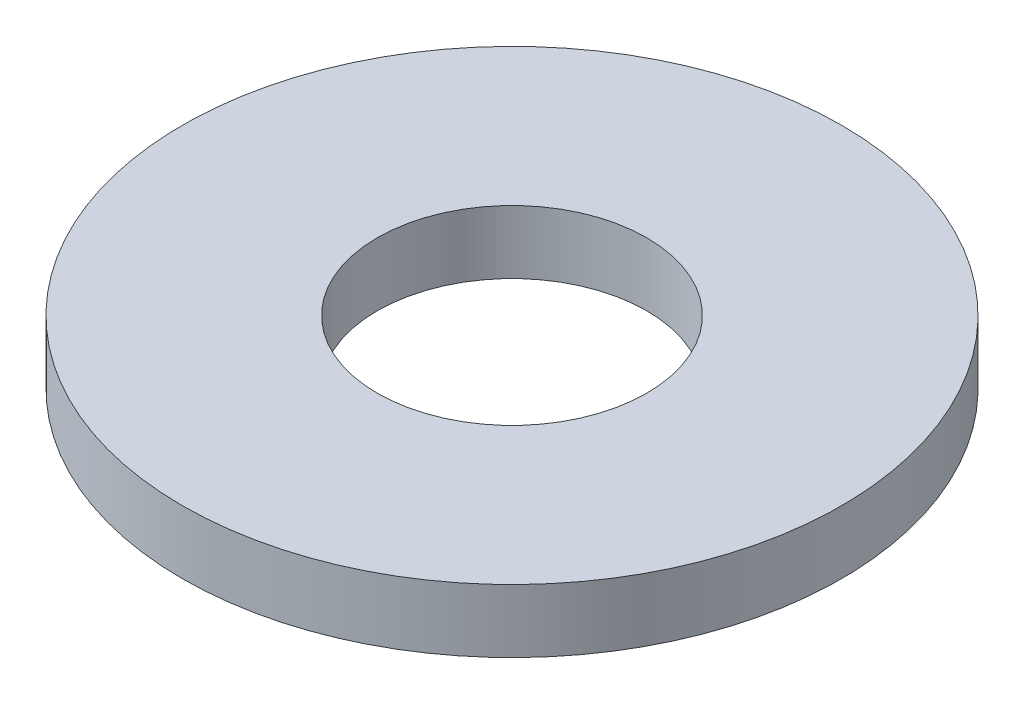
ISO-10303-21;
HEADER;
FILE_DESCRIPTION(('STEP AP214'),'2;1');
FILE_NAME('part.step','',(''),(''),'','','');
FILE_SCHEMA(('AUTOMOTIVE_DESIGN { 1 0 10303 214 1 1 1 1 }'));
ENDSEC;
DATA;
#1=APPLICATION_CONTEXT('core data for automotive mechanical design processes');
#2=APPLICATION_PROTOCOL_DEFINITION('international standard','automotive_design',2000,#1);
#3=PRODUCT_CONTEXT('',#1,'mechanical');
#4=PRODUCT('Part','Part','',(#3));
#5=PRODUCT_RELATED_PRODUCT_CATEGORY('part','',(#4));
#6=PRODUCT_DEFINITION_FORMATION('','',#4);
#7=PRODUCT_DEFINITION_CONTEXT('part definition',#1,'design');
#8=PRODUCT_DEFINITION('design','',#6,#7);
#9=PRODUCT_DEFINITION_SHAPE('','',#8);
#10=(LENGTH_UNIT() NAMED_UNIT(*) SI_UNIT(.MILLI.,.METRE.));
#11=(NAMED_UNIT(*) PLANE_ANGLE_UNIT() SI_UNIT($,.RADIAN.));
#12=(NAMED_UNIT(*) SI_UNIT($,.STERADIAN.) SOLID_ANGLE_UNIT());
#13=UNCERTAINTY_MEASURE_WITH_UNIT(LENGTH_MEASURE(1.E-05),#10,'distance_accuracy_value','');
#14=(GEOMETRIC_REPRESENTATION_CONTEXT(3) GLOBAL_UNCERTAINTY_ASSIGNED_CONTEXT((#13)) GLOBAL_UNIT_ASSIGNED_CONTEXT((#10,
#11,#12)) REPRESENTATION_CONTEXT('',''));
#15=CARTESIAN_POINT('',(0.,0.,0.));
#16=DIRECTION('',(0.,0.,1.));
#17=DIRECTION('',(1.,0.,0.));
#18=AXIS2_PLACEMENT_3D('',#15,#16,#17);
#19=CARTESIAN_POINT('',(0.,3.3528,0.));
#20=DIRECTION('',(0.,-1.,0.));
#21=DIRECTION('',(0.,0.,-1.));
#22=AXIS2_PLACEMENT_3D('',#19,#20,#21);
#23=CYLINDRICAL_SURFACE('',#22,17.4625);
#24=CARTESIAN_POINT('',(0.,3.3528,0.));
#25=DIRECTION('',(0.,1.,0.));
#26=DIRECTION('',(0.,0.,1.));
#27=AXIS2_PLACEMENT_3D('',#24,#25,#26);
#28=CIRCLE('',#27,17.4625);
#29=CARTESIAN_POINT('',(0.,3.3528,17.4625));
#30=VERTEX_POINT('',#29);
#31=EDGE_CURVE('E10',#30,#30,#28,.T.);
#32=ORIENTED_EDGE('',*,*,#31,.F.);
#33=EDGE_LOOP('',(#32));
#34=FACE_BOUND('',#33,.T.);
#35=CARTESIAN_POINT('',(0.,0.,0.));
#36=DIRECTION('',(0.,1.,0.));
#37=DIRECTION('',(0.,0.,1.));
#38=AXIS2_PLACEMENT_3D('',#35,#36,#37);
#39=CIRCLE('',#38,17.4625);
#40=CARTESIAN_POINT('',(0.,0.,17.4625));
#41=VERTEX_POINT('',#40);
#42=EDGE_CURVE('E31',#41,#41,#39,.T.);
#43=ORIENTED_EDGE('',*,*,#42,.T.);
#44=EDGE_LOOP('',(#43));
#45=FACE_BOUND('',#44,.T.);
#46=ADVANCED_FACE('F28',(#34,#45),#23,.T.);
#47=CARTESIAN_POINT('',(0.,3.3528,0.));
#48=DIRECTION('',(0.,1.,0.));
#49=DIRECTION('',(0.,0.,1.));
#50=AXIS2_PLACEMENT_3D('',#47,#48,#49);
#51=PLANE('',#50);
#52=CARTESIAN_POINT('',(0.,3.3528,0.));
#53=DIRECTION('',(0.,1.,0.));
#54=DIRECTION('',(0.,0.,1.));
#55=AXIS2_PLACEMENT_3D('',#52,#53,#54);
#56=CIRCLE('',#55,7.1374);
#57=CARTESIAN_POINT('',(0.,3.3528,7.1374));
#58=VERTEX_POINT('',#57);
#59=EDGE_CURVE('E40',#58,#58,#56,.T.);
#60=ORIENTED_EDGE('',*,*,#59,.F.);
#61=EDGE_LOOP('',(#60));
#62=FACE_BOUND('',#61,.T.);
#63=ORIENTED_EDGE('',*,*,#31,.T.);
#64=EDGE_LOOP('',(#63));
#65=FACE_BOUND('',#64,.T.);
#66=ADVANCED_FACE('F55',(#62,#65),#51,.T.);
#67=CARTESIAN_POINT('',(0.,0.,0.));
#68=DIRECTION('',(0.,1.,0.));
#69=DIRECTION('',(0.,0.,1.));
#70=AXIS2_PLACEMENT_3D('',#67,#68,#69);
#71=PLANE('',#70);
#72=CARTESIAN_POINT('',(0.,0.,0.));
#73=DIRECTION('',(0.,1.,0.));
#74=DIRECTION('',(0.,0.,1.));
#75=AXIS2_PLACEMENT_3D('',#72,#73,#74);
#76=CIRCLE('',#75,7.1374);
#77=CARTESIAN_POINT('',(0.,0.,7.1374));
#78=VERTEX_POINT('',#77);
#79=EDGE_CURVE('E38',#78,#78,#76,.T.);
#80=ORIENTED_EDGE('',*,*,#79,.T.);
#81=EDGE_LOOP('',(#80));
#82=FACE_BOUND('',#81,.T.);
#83=ORIENTED_EDGE('',*,*,#42,.F.);
#84=EDGE_LOOP('',(#83));
#85=FACE_BOUND('',#84,.T.);
#86=ADVANCED_FACE('F46',(#82,#85),#71,.F.);
#87=CARTESIAN_POINT('',(0.,0.,0.));
#88=DIRECTION('',(0.,1.,0.));
#89=DIRECTION('',(0.,0.,1.));
#90=AXIS2_PLACEMENT_3D('',#87,#88,#89);
#91=CYLINDRICAL_SURFACE('',#90,7.1374);
#92=ORIENTED_EDGE('',*,*,#79,.F.);
#93=EDGE_LOOP('',(#92));
#94=FACE_BOUND('',#93,.T.);
#95=ORIENTED_EDGE('',*,*,#59,.T.);
#96=EDGE_LOOP('',(#95));
#97=FACE_BOUND('',#96,.T.);
#98=ADVANCED_FACE('F49',(#94,#97),#91,.F.);
#99=CLOSED_SHELL('',(#46,#66,#86,#98));
#100=MANIFOLD_SOLID_BREP('B2',#99);
#101=ADVANCED_BREP_SHAPE_REPRESENTATION('',(#18,#100),#14);
#102=SHAPE_DEFINITION_REPRESENTATION(#9,#101);
ENDSEC;
END-ISO-10303-21;
